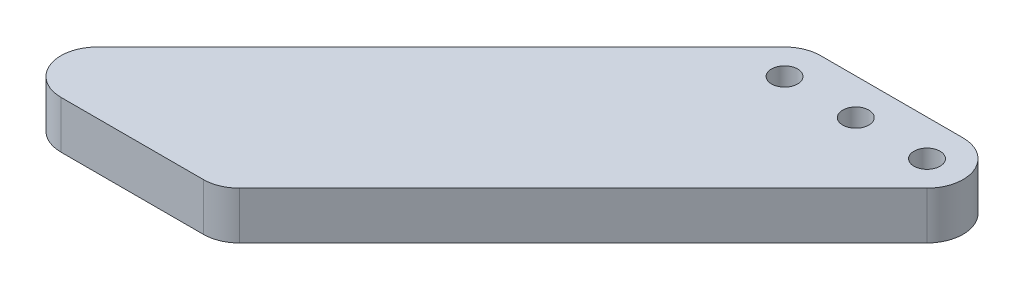
ISO-10303-21;
HEADER;
FILE_DESCRIPTION(('STEP AP214'),'2;1');
FILE_NAME('part.step','',(''),(''),'','','');
FILE_SCHEMA(('AUTOMOTIVE_DESIGN { 1 0 10303 214 1 1 1 1 }'));
ENDSEC;
DATA;
#1=APPLICATION_CONTEXT('core data for automotive mechanical design processes');
#2=APPLICATION_PROTOCOL_DEFINITION('international standard','automotive_design',2000,#1);
#3=PRODUCT_CONTEXT('',#1,'mechanical');
#4=PRODUCT('Part','Part','',(#3));
#5=PRODUCT_RELATED_PRODUCT_CATEGORY('part','',(#4));
#6=PRODUCT_DEFINITION_FORMATION('','',#4);
#7=PRODUCT_DEFINITION_CONTEXT('part definition',#1,'design');
#8=PRODUCT_DEFINITION('design','',#6,#7);
#9=PRODUCT_DEFINITION_SHAPE('','',#8);
#10=(LENGTH_UNIT() NAMED_UNIT(*) SI_UNIT(.MILLI.,.METRE.));
#11=(NAMED_UNIT(*) PLANE_ANGLE_UNIT() SI_UNIT($,.RADIAN.));
#12=(NAMED_UNIT(*) SI_UNIT($,.STERADIAN.) SOLID_ANGLE_UNIT());
#13=UNCERTAINTY_MEASURE_WITH_UNIT(LENGTH_MEASURE(1.E-05),#10,'distance_accuracy_value','');
#14=(GEOMETRIC_REPRESENTATION_CONTEXT(3) GLOBAL_UNCERTAINTY_ASSIGNED_CONTEXT((#13)) GLOBAL_UNIT_ASSIGNED_CONTEXT((#10,
#11,#12)) REPRESENTATION_CONTEXT('',''));
#15=CARTESIAN_POINT('',(0.,0.,0.));
#16=DIRECTION('',(0.,0.,1.));
#17=DIRECTION('',(1.,0.,0.));
#18=AXIS2_PLACEMENT_3D('',#15,#16,#17);
#19=CARTESIAN_POINT('',(-15.,5.,0.));
#20=DIRECTION('',(0.,-1.,0.));
#21=DIRECTION('',(0.,0.,-1.));
#22=AXIS2_PLACEMENT_3D('',#19,#20,#21);
#23=CYLINDRICAL_SURFACE('',#22,7.6);
#24=CARTESIAN_POINT('',(-15.,-5.,0.));
#25=DIRECTION('',(0.,1.,0.));
#26=DIRECTION('',(0.,0.,1.));
#27=AXIS2_PLACEMENT_3D('',#24,#25,#26);
#28=CIRCLE('',#27,7.6);
#29=CARTESIAN_POINT('',(-15.,-5.,-7.6));
#30=VERTEX_POINT('',#29);
#31=CARTESIAN_POINT('',(-20.3740115370177,-5.,-5.37401153701779));
#32=VERTEX_POINT('',#31);
#33=EDGE_CURVE('E119',#30,#32,#28,.T.);
#34=ORIENTED_EDGE('',*,*,#33,.T.);
#35=DIRECTION('',(0.,-1.,0.));
#36=VECTOR('',#35,1.);
#37=CARTESIAN_POINT('',(-20.3740115370177,5.,-5.37401153701779));
#38=LINE('',#37,#36);
#39=CARTESIAN_POINT('',(-20.3740115370177,5.,-5.37401153701779));
#40=VERTEX_POINT('',#39);
#41=EDGE_CURVE('E102',#40,#32,#38,.T.);
#42=ORIENTED_EDGE('',*,*,#41,.F.);
#43=CARTESIAN_POINT('',(-15.,5.,0.));
#44=DIRECTION('',(0.,1.,0.));
#45=DIRECTION('',(0.,0.,1.));
#46=AXIS2_PLACEMENT_3D('',#43,#44,#45);
#47=CIRCLE('',#46,7.6);
#48=CARTESIAN_POINT('',(-15.,5.,-7.6));
#49=VERTEX_POINT('',#48);
#50=EDGE_CURVE('E107',#49,#40,#47,.T.);
#51=ORIENTED_EDGE('',*,*,#50,.F.);
#52=DIRECTION('',(0.,-1.,0.));
#53=VECTOR('',#52,1.);
#54=CARTESIAN_POINT('',(-15.,5.,-7.6));
#55=LINE('',#54,#53);
#56=EDGE_CURVE('E169',#49,#30,#55,.T.);
#57=ORIENTED_EDGE('',*,*,#56,.T.);
#58=EDGE_LOOP('',(#34,#42,#51,#57));
#59=FACE_BOUND('',#58,.T.);
#60=ADVANCED_FACE('F34',(#59),#23,.T.);
#61=CARTESIAN_POINT('',(-20.3740115370177,5.,-5.37401153701779));
#62=DIRECTION('',(0.707106781186544,0.,0.707106781186551));
#63=DIRECTION('',(0.707106781186551,0.,-0.707106781186544));
#64=AXIS2_PLACEMENT_3D('',#61,#62,#63);
#65=PLANE('',#64);
#66=DIRECTION('',(-0.707106781186551,0.,0.707106781186544));
#67=VECTOR('',#66,1.);
#68=CARTESIAN_POINT('',(-20.3740115370177,-5.,-5.37401153701779));
#69=LINE('',#68,#67);
#70=CARTESIAN_POINT('',(-92.7740115370185,-5.,67.0259884629822));
#71=VERTEX_POINT('',#70);
#72=EDGE_CURVE('E160',#32,#71,#69,.T.);
#73=ORIENTED_EDGE('',*,*,#72,.T.);
#74=DIRECTION('',(0.,-1.,0.));
#75=VECTOR('',#74,1.);
#76=CARTESIAN_POINT('',(-92.7740115370185,5.,67.0259884629822));
#77=LINE('',#76,#75);
#78=CARTESIAN_POINT('',(-92.7740115370185,5.,67.0259884629822));
#79=VERTEX_POINT('',#78);
#80=EDGE_CURVE('E11',#71,#79,#77,.F.);
#81=ORIENTED_EDGE('',*,*,#80,.T.);
#82=DIRECTION('',(-0.707106781186551,0.,0.707106781186544));
#83=VECTOR('',#82,1.);
#84=CARTESIAN_POINT('',(-20.3740115370177,5.,-5.37401153701779));
#85=LINE('',#84,#83);
#86=EDGE_CURVE('E98',#40,#79,#85,.T.);
#87=ORIENTED_EDGE('',*,*,#86,.F.);
#88=ORIENTED_EDGE('',*,*,#41,.T.);
#89=EDGE_LOOP('',(#73,#81,#87,#88));
#90=FACE_BOUND('',#89,.T.);
#91=ADVANCED_FACE('F100',(#90),#65,.F.);
#92=CARTESIAN_POINT('',(-105.748023074036,5.,80.));
#93=DIRECTION('',(0.,0.,-1.));
#94=DIRECTION('',(-1.,0.,0.));
#95=AXIS2_PLACEMENT_3D('',#92,#93,#94);
#96=PLANE('',#95);
#97=DIRECTION('',(1.,0.,0.));
#98=VECTOR('',#97,1.);
#99=CARTESIAN_POINT('',(-105.748023074036,-5.,80.));
#100=LINE('',#99,#98);
#101=CARTESIAN_POINT('',(-87.4000000000008,-5.,80.));
#102=VERTEX_POINT('',#101);
#103=CARTESIAN_POINT('',(-57.4000000000007,-5.,80.));
#104=VERTEX_POINT('',#103);
#105=EDGE_CURVE('E155',#102,#104,#100,.T.);
#106=ORIENTED_EDGE('',*,*,#105,.T.);
#107=DIRECTION('',(0.,-1.,0.));
#108=VECTOR('',#107,1.);
#109=CARTESIAN_POINT('',(-57.4000000000007,5.,80.));
#110=LINE('',#109,#108);
#111=CARTESIAN_POINT('',(-57.4000000000007,5.,80.));
#112=VERTEX_POINT('',#111);
#113=EDGE_CURVE('E55',#104,#112,#110,.F.);
#114=ORIENTED_EDGE('',*,*,#113,.T.);
#115=DIRECTION('',(1.,0.,0.));
#116=VECTOR('',#115,1.);
#117=CARTESIAN_POINT('',(-105.748023074036,5.,80.));
#118=LINE('',#117,#116);
#119=CARTESIAN_POINT('',(-87.4000000000008,5.,80.));
#120=VERTEX_POINT('',#119);
#121=EDGE_CURVE('E106',#120,#112,#118,.T.);
#122=ORIENTED_EDGE('',*,*,#121,.F.);
#123=DIRECTION('',(0.,-1.,0.));
#124=VECTOR('',#123,1.);
#125=CARTESIAN_POINT('',(-87.4000000000008,5.,80.));
#126=LINE('',#125,#124);
#127=EDGE_CURVE('E134',#120,#102,#126,.T.);
#128=ORIENTED_EDGE('',*,*,#127,.T.);
#129=EDGE_LOOP('',(#106,#114,#122,#128));
#130=FACE_BOUND('',#129,.T.);
#131=ADVANCED_FACE('F158',(#130),#96,.F.);
#132=CARTESIAN_POINT('',(-54.2519769259652,5.,80.));
#133=DIRECTION('',(-0.707106781186544,0.,-0.707106781186551));
#134=DIRECTION('',(-0.707106781186551,0.,0.707106781186544));
#135=AXIS2_PLACEMENT_3D('',#132,#133,#134);
#136=PLANE('',#135);
#137=DIRECTION('',(0.707106781186551,0.,-0.707106781186544));
#138=VECTOR('',#137,1.);
#139=CARTESIAN_POINT('',(-54.2519769259652,5.,80.));
#140=LINE('',#139,#138);
#141=CARTESIAN_POINT('',(-52.025988462983,5.,77.7740115370178));
#142=VERTEX_POINT('',#141);
#143=CARTESIAN_POINT('',(20.3740115370177,5.,5.37401153701779));
#144=VERTEX_POINT('',#143);
#145=EDGE_CURVE('E141',#142,#144,#140,.T.);
#146=ORIENTED_EDGE('',*,*,#145,.F.);
#147=DIRECTION('',(0.,-1.,0.));
#148=VECTOR('',#147,1.);
#149=CARTESIAN_POINT('',(-52.025988462983,5.,77.7740115370178));
#150=LINE('',#149,#148);
#151=CARTESIAN_POINT('',(-52.025988462983,-5.,77.7740115370178));
#152=VERTEX_POINT('',#151);
#153=EDGE_CURVE('E120',#142,#152,#150,.T.);
#154=ORIENTED_EDGE('',*,*,#153,.T.);
#155=DIRECTION('',(0.707106781186551,0.,-0.707106781186544));
#156=VECTOR('',#155,1.);
#157=CARTESIAN_POINT('',(-54.2519769259652,-5.,80.));
#158=LINE('',#157,#156);
#159=CARTESIAN_POINT('',(20.3740115370177,-5.,5.37401153701779));
#160=VERTEX_POINT('',#159);
#161=EDGE_CURVE('E157',#152,#160,#158,.T.);
#162=ORIENTED_EDGE('',*,*,#161,.T.);
#163=DIRECTION('',(0.,-1.,0.));
#164=VECTOR('',#163,1.);
#165=CARTESIAN_POINT('',(20.3740115370177,5.,5.37401153701779));
#166=LINE('',#165,#164);
#167=EDGE_CURVE('E121',#144,#160,#166,.T.);
#168=ORIENTED_EDGE('',*,*,#167,.F.);
#169=EDGE_LOOP('',(#146,#154,#162,#168));
#170=FACE_BOUND('',#169,.T.);
#171=ADVANCED_FACE('F146',(#170),#136,.F.);
#172=CARTESIAN_POINT('',(15.,5.,0.));
#173=DIRECTION('',(0.,-1.,0.));
#174=DIRECTION('',(0.,0.,-1.));
#175=AXIS2_PLACEMENT_3D('',#172,#173,#174);
#176=CYLINDRICAL_SURFACE('',#175,7.6);
#177=CARTESIAN_POINT('',(15.,-5.,0.));
#178=DIRECTION('',(0.,1.,0.));
#179=DIRECTION('',(0.,0.,-1.));
#180=AXIS2_PLACEMENT_3D('',#177,#178,#179);
#181=CIRCLE('',#180,7.6);
#182=CARTESIAN_POINT('',(15.,-5.,-7.6));
#183=VERTEX_POINT('',#182);
#184=EDGE_CURVE('E162',#160,#183,#181,.T.);
#185=ORIENTED_EDGE('',*,*,#184,.T.);
#186=DIRECTION('',(0.,-1.,0.));
#187=VECTOR('',#186,1.);
#188=CARTESIAN_POINT('',(15.,5.,-7.6));
#189=LINE('',#188,#187);
#190=CARTESIAN_POINT('',(15.,5.,-7.6));
#191=VERTEX_POINT('',#190);
#192=EDGE_CURVE('E127',#191,#183,#189,.T.);
#193=ORIENTED_EDGE('',*,*,#192,.F.);
#194=CARTESIAN_POINT('',(15.,5.,0.));
#195=DIRECTION('',(0.,1.,0.));
#196=DIRECTION('',(0.,0.,-1.));
#197=AXIS2_PLACEMENT_3D('',#194,#195,#196);
#198=CIRCLE('',#197,7.6);
#199=EDGE_CURVE('E149',#144,#191,#198,.T.);
#200=ORIENTED_EDGE('',*,*,#199,.F.);
#201=ORIENTED_EDGE('',*,*,#167,.T.);
#202=EDGE_LOOP('',(#185,#193,#200,#201));
#203=FACE_BOUND('',#202,.T.);
#204=ADVANCED_FACE('F240',(#203),#176,.T.);
#205=CARTESIAN_POINT('',(-15.,5.,-7.6));
#206=DIRECTION('',(0.,0.,1.));
#207=DIRECTION('',(1.,0.,0.));
#208=AXIS2_PLACEMENT_3D('',#205,#206,#207);
#209=PLANE('',#208);
#210=DIRECTION('',(-1.,0.,0.));
#211=VECTOR('',#210,1.);
#212=CARTESIAN_POINT('',(-15.,-5.,-7.6));
#213=LINE('',#212,#211);
#214=EDGE_CURVE('E116',#183,#30,#213,.T.);
#215=ORIENTED_EDGE('',*,*,#214,.T.);
#216=ORIENTED_EDGE('',*,*,#56,.F.);
#217=DIRECTION('',(-1.,0.,0.));
#218=VECTOR('',#217,1.);
#219=CARTESIAN_POINT('',(-15.,5.,-7.6));
#220=LINE('',#219,#218);
#221=EDGE_CURVE('E112',#191,#49,#220,.T.);
#222=ORIENTED_EDGE('',*,*,#221,.F.);
#223=ORIENTED_EDGE('',*,*,#192,.T.);
#224=EDGE_LOOP('',(#215,#216,#222,#223));
#225=FACE_BOUND('',#224,.T.);
#226=ADVANCED_FACE('F174',(#225),#209,.F.);
#227=CARTESIAN_POINT('',(-15.,5.,0.));
#228=DIRECTION('',(0.,1.,0.));
#229=DIRECTION('',(0.,0.,1.));
#230=AXIS2_PLACEMENT_3D('',#227,#228,#229);
#231=PLANE('',#230);
#232=CARTESIAN_POINT('',(-15.,5.,0.));
#233=DIRECTION('',(0.,1.,0.));
#234=DIRECTION('',(0.,0.,1.));
#235=AXIS2_PLACEMENT_3D('',#232,#233,#234);
#236=CIRCLE('',#235,2.74999999999999);
#237=CARTESIAN_POINT('',(-15.,5.,2.74999999999999));
#238=VERTEX_POINT('',#237);
#239=EDGE_CURVE('E195',#238,#238,#236,.T.);
#240=ORIENTED_EDGE('',*,*,#239,.F.);
#241=EDGE_LOOP('',(#240));
#242=FACE_BOUND('',#241,.T.);
#243=CARTESIAN_POINT('',(0.,5.,0.));
#244=DIRECTION('',(0.,1.,0.));
#245=DIRECTION('',(0.,0.,1.));
#246=AXIS2_PLACEMENT_3D('',#243,#244,#245);
#247=CIRCLE('',#246,2.74999999999999);
#248=CARTESIAN_POINT('',(0.,5.,2.74999999999999));
#249=VERTEX_POINT('',#248);
#250=EDGE_CURVE('E189',#249,#249,#247,.T.);
#251=ORIENTED_EDGE('',*,*,#250,.F.);
#252=EDGE_LOOP('',(#251));
#253=FACE_BOUND('',#252,.T.);
#254=CARTESIAN_POINT('',(15.,5.,0.));
#255=DIRECTION('',(0.,1.,0.));
#256=DIRECTION('',(0.,0.,1.));
#257=AXIS2_PLACEMENT_3D('',#254,#255,#256);
#258=CIRCLE('',#257,2.74999999999999);
#259=CARTESIAN_POINT('',(15.,5.,2.74999999999999));
#260=VERTEX_POINT('',#259);
#261=EDGE_CURVE('E178',#260,#260,#258,.T.);
#262=ORIENTED_EDGE('',*,*,#261,.F.);
#263=EDGE_LOOP('',(#262));
#264=FACE_BOUND('',#263,.T.);
#265=ORIENTED_EDGE('',*,*,#121,.T.);
#266=CARTESIAN_POINT('',(-57.4000000000007,5.,72.4));
#267=DIRECTION('',(0.,1.,0.));
#268=DIRECTION('',(0.,0.,1.));
#269=AXIS2_PLACEMENT_3D('',#266,#267,#268);
#270=CIRCLE('',#269,7.6);
#271=EDGE_CURVE('E42',#112,#142,#270,.T.);
#272=ORIENTED_EDGE('',*,*,#271,.T.);
#273=ORIENTED_EDGE('',*,*,#145,.T.);
#274=ORIENTED_EDGE('',*,*,#199,.T.);
#275=ORIENTED_EDGE('',*,*,#221,.T.);
#276=ORIENTED_EDGE('',*,*,#50,.T.);
#277=ORIENTED_EDGE('',*,*,#86,.T.);
#278=CARTESIAN_POINT('',(-87.4000000000008,5.,72.4));
#279=DIRECTION('',(0.,1.,0.));
#280=DIRECTION('',(0.,0.,1.));
#281=AXIS2_PLACEMENT_3D('',#278,#279,#280);
#282=CIRCLE('',#281,7.6);
#283=EDGE_CURVE('E138',#79,#120,#282,.T.);
#284=ORIENTED_EDGE('',*,*,#283,.T.);
#285=EDGE_LOOP('',(#265,#272,#273,#274,#275,#276,#277,#284));
#286=FACE_BOUND('',#285,.T.);
#287=ADVANCED_FACE('F110',(#242,#253,#264,#286),#231,.T.);
#288=CARTESIAN_POINT('',(-15.,-5.,0.));
#289=DIRECTION('',(0.,1.,0.));
#290=DIRECTION('',(0.,0.,1.));
#291=AXIS2_PLACEMENT_3D('',#288,#289,#290);
#292=PLANE('',#291);
#293=CARTESIAN_POINT('',(-15.,-5.,0.));
#294=DIRECTION('',(0.,1.,0.));
#295=DIRECTION('',(0.,0.,1.));
#296=AXIS2_PLACEMENT_3D('',#293,#294,#295);
#297=CIRCLE('',#296,2.74999999999999);
#298=CARTESIAN_POINT('',(-15.,-5.,2.74999999999999));
#299=VERTEX_POINT('',#298);
#300=EDGE_CURVE('E192',#299,#299,#297,.T.);
#301=ORIENTED_EDGE('',*,*,#300,.T.);
#302=EDGE_LOOP('',(#301));
#303=FACE_BOUND('',#302,.T.);
#304=CARTESIAN_POINT('',(0.,-5.,0.));
#305=DIRECTION('',(0.,1.,0.));
#306=DIRECTION('',(0.,0.,1.));
#307=AXIS2_PLACEMENT_3D('',#304,#305,#306);
#308=CIRCLE('',#307,2.74999999999999);
#309=CARTESIAN_POINT('',(0.,-5.,2.74999999999999));
#310=VERTEX_POINT('',#309);
#311=EDGE_CURVE('E186',#310,#310,#308,.T.);
#312=ORIENTED_EDGE('',*,*,#311,.T.);
#313=EDGE_LOOP('',(#312));
#314=FACE_BOUND('',#313,.T.);
#315=CARTESIAN_POINT('',(15.,-5.,0.));
#316=DIRECTION('',(0.,1.,0.));
#317=DIRECTION('',(0.,0.,1.));
#318=AXIS2_PLACEMENT_3D('',#315,#316,#317);
#319=CIRCLE('',#318,2.74999999999999);
#320=CARTESIAN_POINT('',(15.,-5.,2.74999999999999));
#321=VERTEX_POINT('',#320);
#322=EDGE_CURVE('E176',#321,#321,#319,.T.);
#323=ORIENTED_EDGE('',*,*,#322,.T.);
#324=EDGE_LOOP('',(#323));
#325=FACE_BOUND('',#324,.T.);
#326=ORIENTED_EDGE('',*,*,#161,.F.);
#327=CARTESIAN_POINT('',(-57.4000000000007,-5.,72.4));
#328=DIRECTION('',(0.,1.,0.));
#329=DIRECTION('',(0.,0.,1.));
#330=AXIS2_PLACEMENT_3D('',#327,#328,#329);
#331=CIRCLE('',#330,7.6);
#332=EDGE_CURVE('E132',#152,#104,#331,.F.);
#333=ORIENTED_EDGE('',*,*,#332,.T.);
#334=ORIENTED_EDGE('',*,*,#105,.F.);
#335=CARTESIAN_POINT('',(-87.4000000000008,-5.,72.4));
#336=DIRECTION('',(0.,1.,0.));
#337=DIRECTION('',(0.,0.,1.));
#338=AXIS2_PLACEMENT_3D('',#335,#336,#337);
#339=CIRCLE('',#338,7.6);
#340=EDGE_CURVE('E124',#102,#71,#339,.F.);
#341=ORIENTED_EDGE('',*,*,#340,.T.);
#342=ORIENTED_EDGE('',*,*,#72,.F.);
#343=ORIENTED_EDGE('',*,*,#33,.F.);
#344=ORIENTED_EDGE('',*,*,#214,.F.);
#345=ORIENTED_EDGE('',*,*,#184,.F.);
#346=EDGE_LOOP('',(#326,#333,#334,#341,#342,#343,#344,#345));
#347=FACE_BOUND('',#346,.T.);
#348=ADVANCED_FACE('F154',(#303,#314,#325,#347),#292,.F.);
#349=CARTESIAN_POINT('',(-57.4000000000007,5.,72.4));
#350=DIRECTION('',(0.,-1.,0.));
#351=DIRECTION('',(0.,0.,-1.));
#352=AXIS2_PLACEMENT_3D('',#349,#350,#351);
#353=CYLINDRICAL_SURFACE('',#352,7.6);
#354=ORIENTED_EDGE('',*,*,#271,.F.);
#355=ORIENTED_EDGE('',*,*,#113,.F.);
#356=ORIENTED_EDGE('',*,*,#332,.F.);
#357=ORIENTED_EDGE('',*,*,#153,.F.);
#358=EDGE_LOOP('',(#354,#355,#356,#357));
#359=FACE_BOUND('',#358,.T.);
#360=ADVANCED_FACE('F151',(#359),#353,.T.);
#361=CARTESIAN_POINT('',(-87.4000000000008,5.,72.4));
#362=DIRECTION('',(0.,-1.,0.));
#363=DIRECTION('',(0.,0.,-1.));
#364=AXIS2_PLACEMENT_3D('',#361,#362,#363);
#365=CYLINDRICAL_SURFACE('',#364,7.6);
#366=ORIENTED_EDGE('',*,*,#283,.F.);
#367=ORIENTED_EDGE('',*,*,#80,.F.);
#368=ORIENTED_EDGE('',*,*,#340,.F.);
#369=ORIENTED_EDGE('',*,*,#127,.F.);
#370=EDGE_LOOP('',(#366,#367,#368,#369));
#371=FACE_BOUND('',#370,.T.);
#372=ADVANCED_FACE('F36',(#371),#365,.T.);
#373=CARTESIAN_POINT('',(15.,5.,0.));
#374=DIRECTION('',(0.,1.,0.));
#375=DIRECTION('',(0.,0.,1.));
#376=AXIS2_PLACEMENT_3D('',#373,#374,#375);
#377=CYLINDRICAL_SURFACE('',#376,2.74999999999999);
#378=ORIENTED_EDGE('',*,*,#322,.F.);
#379=EDGE_LOOP('',(#378));
#380=FACE_BOUND('',#379,.T.);
#381=ORIENTED_EDGE('',*,*,#261,.T.);
#382=EDGE_LOOP('',(#381));
#383=FACE_BOUND('',#382,.T.);
#384=ADVANCED_FACE('F208',(#380,#383),#377,.F.);
#385=CARTESIAN_POINT('',(0.,5.,0.));
#386=DIRECTION('',(0.,1.,0.));
#387=DIRECTION('',(0.,0.,1.));
#388=AXIS2_PLACEMENT_3D('',#385,#386,#387);
#389=CYLINDRICAL_SURFACE('',#388,2.74999999999999);
#390=ORIENTED_EDGE('',*,*,#311,.F.);
#391=EDGE_LOOP('',(#390));
#392=FACE_BOUND('',#391,.T.);
#393=ORIENTED_EDGE('',*,*,#250,.T.);
#394=EDGE_LOOP('',(#393));
#395=FACE_BOUND('',#394,.T.);
#396=ADVANCED_FACE('F210',(#392,#395),#389,.F.);
#397=CARTESIAN_POINT('',(-15.,5.,0.));
#398=DIRECTION('',(0.,1.,0.));
#399=DIRECTION('',(0.,0.,1.));
#400=AXIS2_PLACEMENT_3D('',#397,#398,#399);
#401=CYLINDRICAL_SURFACE('',#400,2.74999999999999);
#402=ORIENTED_EDGE('',*,*,#300,.F.);
#403=EDGE_LOOP('',(#402));
#404=FACE_BOUND('',#403,.T.);
#405=ORIENTED_EDGE('',*,*,#239,.T.);
#406=EDGE_LOOP('',(#405));
#407=FACE_BOUND('',#406,.T.);
#408=ADVANCED_FACE('F199',(#404,#407),#401,.F.);
#409=CLOSED_SHELL('',(#60,#91,#131,#171,#204,#226,#287,#348,#360,#372,#384,#396,#408));
#410=MANIFOLD_SOLID_BREP('B2',#409);
#411=ADVANCED_BREP_SHAPE_REPRESENTATION('',(#18,#410),#14);
#412=SHAPE_DEFINITION_REPRESENTATION(#9,#411);
ENDSEC;
END-ISO-10303-21;
